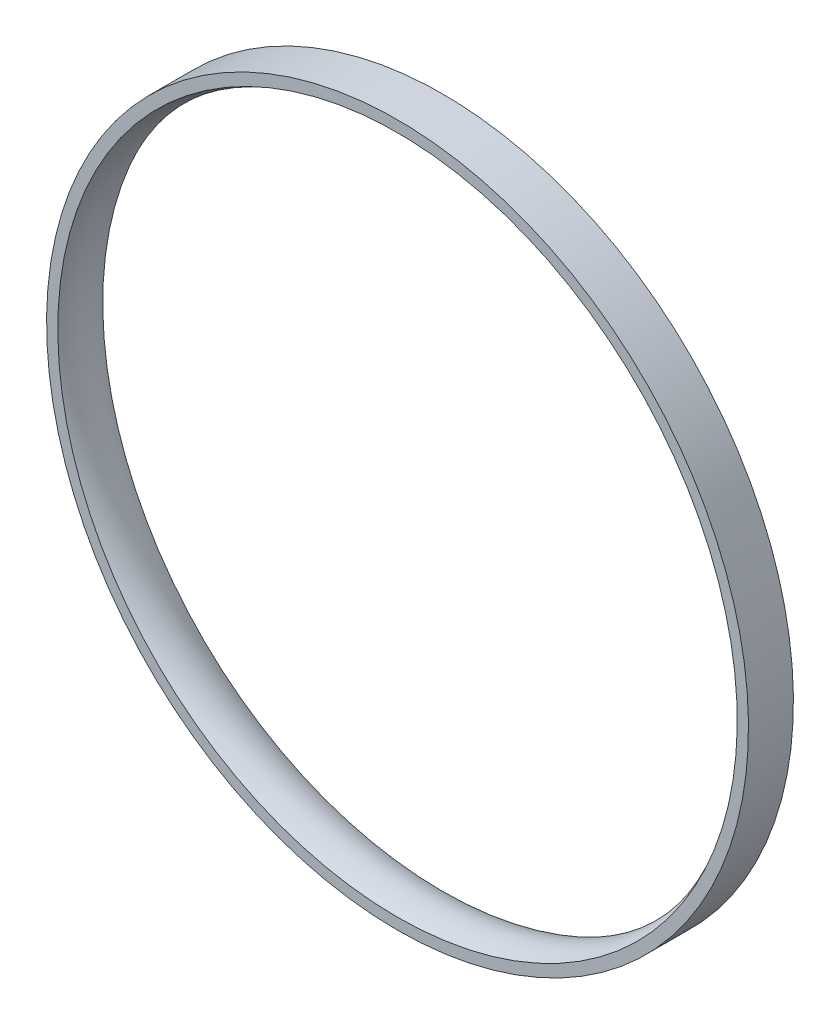
ISO-10303-21;
HEADER;
FILE_DESCRIPTION(('STEP AP214'),'2;1');
FILE_NAME('part.step','',(''),(''),'','','');
FILE_SCHEMA(('AUTOMOTIVE_DESIGN { 1 0 10303 214 1 1 1 1 }'));
ENDSEC;
DATA;
#1=APPLICATION_CONTEXT('core data for automotive mechanical design processes');
#2=APPLICATION_PROTOCOL_DEFINITION('international standard','automotive_design',2000,#1);
#3=PRODUCT_CONTEXT('',#1,'mechanical');
#4=PRODUCT('Part','Part','',(#3));
#5=PRODUCT_RELATED_PRODUCT_CATEGORY('part','',(#4));
#6=PRODUCT_DEFINITION_FORMATION('','',#4);
#7=PRODUCT_DEFINITION_CONTEXT('part definition',#1,'design');
#8=PRODUCT_DEFINITION('design','',#6,#7);
#9=PRODUCT_DEFINITION_SHAPE('','',#8);
#10=(LENGTH_UNIT() NAMED_UNIT(*) SI_UNIT(.MILLI.,.METRE.));
#11=(NAMED_UNIT(*) PLANE_ANGLE_UNIT() SI_UNIT($,.RADIAN.));
#12=(NAMED_UNIT(*) SI_UNIT($,.STERADIAN.) SOLID_ANGLE_UNIT());
#13=UNCERTAINTY_MEASURE_WITH_UNIT(LENGTH_MEASURE(1.E-05),#10,'distance_accuracy_value','');
#14=(GEOMETRIC_REPRESENTATION_CONTEXT(3) GLOBAL_UNCERTAINTY_ASSIGNED_CONTEXT((#13)) GLOBAL_UNIT_ASSIGNED_CONTEXT((#10,
#11,#12)) REPRESENTATION_CONTEXT('',''));
#15=CARTESIAN_POINT('',(0.,0.,0.));
#16=DIRECTION('',(0.,0.,1.));
#17=DIRECTION('',(1.,0.,0.));
#18=AXIS2_PLACEMENT_3D('',#15,#16,#17);
#19=CARTESIAN_POINT('',(0.,0.,0.));
#20=DIRECTION('',(0.,0.,1.));
#21=DIRECTION('',(1.,0.,0.));
#22=AXIS2_PLACEMENT_3D('',#19,#20,#21);
#23=CYLINDRICAL_SURFACE('',#22,156.15);
#24=DIRECTION('',(0.,0.,-1.));
#25=VECTOR('',#24,1.);
#26=CARTESIAN_POINT('',(0.,-156.15,10.));
#27=LINE('',#26,#25);
#28=CARTESIAN_POINT('',(0.,-156.15,10.));
#29=VERTEX_POINT('',#28);
#30=CARTESIAN_POINT('',(0.,-156.15,-10.));
#31=VERTEX_POINT('',#30);
#32=EDGE_CURVE('E36',#29,#31,#27,.T.);
#33=ORIENTED_EDGE('',*,*,#32,.F.);
#34=CARTESIAN_POINT('',(0.,0.,10.));
#35=DIRECTION('',(0.,0.,1.));
#36=DIRECTION('',(0.,-1.,0.));
#37=AXIS2_PLACEMENT_3D('',#34,#35,#36);
#38=CIRCLE('',#37,156.15);
#39=EDGE_CURVE('E11',#29,#29,#38,.T.);
#40=ORIENTED_EDGE('',*,*,#39,.F.);
#41=ORIENTED_EDGE('',*,*,#32,.T.);
#42=CARTESIAN_POINT('',(0.,0.,-10.));
#43=DIRECTION('',(0.,0.,1.));
#44=DIRECTION('',(0.,-1.,0.));
#45=AXIS2_PLACEMENT_3D('',#42,#43,#44);
#46=CIRCLE('',#45,156.15);
#47=EDGE_CURVE('E62',#31,#31,#46,.T.);
#48=ORIENTED_EDGE('',*,*,#47,.T.);
#49=EDGE_LOOP('',(#33,#40,#41,#48));
#50=FACE_BOUND('',#49,.T.);
#51=ADVANCED_FACE('F33',(#50),#23,.T.);
#52=CARTESIAN_POINT('',(0.,-156.15,10.));
#53=DIRECTION('',(0.,0.,1.));
#54=DIRECTION('',(1.,0.,0.));
#55=AXIS2_PLACEMENT_3D('',#52,#53,#54);
#56=PLANE('',#55);
#57=ORIENTED_EDGE('',*,*,#39,.T.);
#58=EDGE_LOOP('',(#57));
#59=FACE_BOUND('',#58,.T.);
#60=CARTESIAN_POINT('',(0.,0.,10.));
#61=DIRECTION('',(0.,0.,1.));
#62=DIRECTION('',(0.,-1.,0.));
#63=AXIS2_PLACEMENT_3D('',#60,#61,#62);
#64=CIRCLE('',#63,151.15);
#65=CARTESIAN_POINT('',(0.,-151.15,10.));
#66=VERTEX_POINT('',#65);
#67=EDGE_CURVE('E41',#66,#66,#64,.T.);
#68=ORIENTED_EDGE('',*,*,#67,.F.);
#69=EDGE_LOOP('',(#68));
#70=FACE_BOUND('',#69,.T.);
#71=ADVANCED_FACE('F76',(#59,#70),#56,.T.);
#72=CARTESIAN_POINT('',(0.,0.,0.));
#73=DIRECTION('',(0.,0.,1.));
#74=DIRECTION('',(1.,0.,0.));
#75=AXIS2_PLACEMENT_3D('',#72,#73,#74);
#76=TOROIDAL_SURFACE('',#75,168.470508075689,20.);
#77=CARTESIAN_POINT('',(0.,-168.470508075689,0.));
#78=DIRECTION('',(1.,0.,0.));
#79=DIRECTION('',(0.,0.,1.));
#80=AXIS2_PLACEMENT_3D('',#77,#78,#79);
#81=CIRCLE('',#80,20.);
#82=CARTESIAN_POINT('',(0.,-151.15,-10.));
#83=VERTEX_POINT('',#82);
#84=EDGE_CURVE('E72',#83,#66,#81,.T.);
#85=ORIENTED_EDGE('',*,*,#84,.F.);
#86=CARTESIAN_POINT('',(0.,0.,-10.));
#87=DIRECTION('',(0.,0.,1.));
#88=DIRECTION('',(0.,-1.,0.));
#89=AXIS2_PLACEMENT_3D('',#86,#87,#88);
#90=CIRCLE('',#89,151.15);
#91=EDGE_CURVE('E66',#83,#83,#90,.T.);
#92=ORIENTED_EDGE('',*,*,#91,.F.);
#93=ORIENTED_EDGE('',*,*,#84,.T.);
#94=ORIENTED_EDGE('',*,*,#67,.T.);
#95=EDGE_LOOP('',(#85,#92,#93,#94));
#96=FACE_BOUND('',#95,.T.);
#97=ADVANCED_FACE('F78',(#96),#76,.T.);
#98=CARTESIAN_POINT('',(0.,-156.15,-10.));
#99=DIRECTION('',(0.,0.,-1.));
#100=DIRECTION('',(-1.,0.,0.));
#101=AXIS2_PLACEMENT_3D('',#98,#99,#100);
#102=PLANE('',#101);
#103=ORIENTED_EDGE('',*,*,#91,.T.);
#104=EDGE_LOOP('',(#103));
#105=FACE_BOUND('',#104,.T.);
#106=ORIENTED_EDGE('',*,*,#47,.F.);
#107=EDGE_LOOP('',(#106));
#108=FACE_BOUND('',#107,.T.);
#109=ADVANCED_FACE('F79',(#105,#108),#102,.T.);
#110=CLOSED_SHELL('',(#51,#71,#97,#109));
#111=MANIFOLD_SOLID_BREP('B2',#110);
#112=ADVANCED_BREP_SHAPE_REPRESENTATION('',(#18,#111),#14);
#113=SHAPE_DEFINITION_REPRESENTATION(#9,#112);
ENDSEC;
END-ISO-10303-21;
